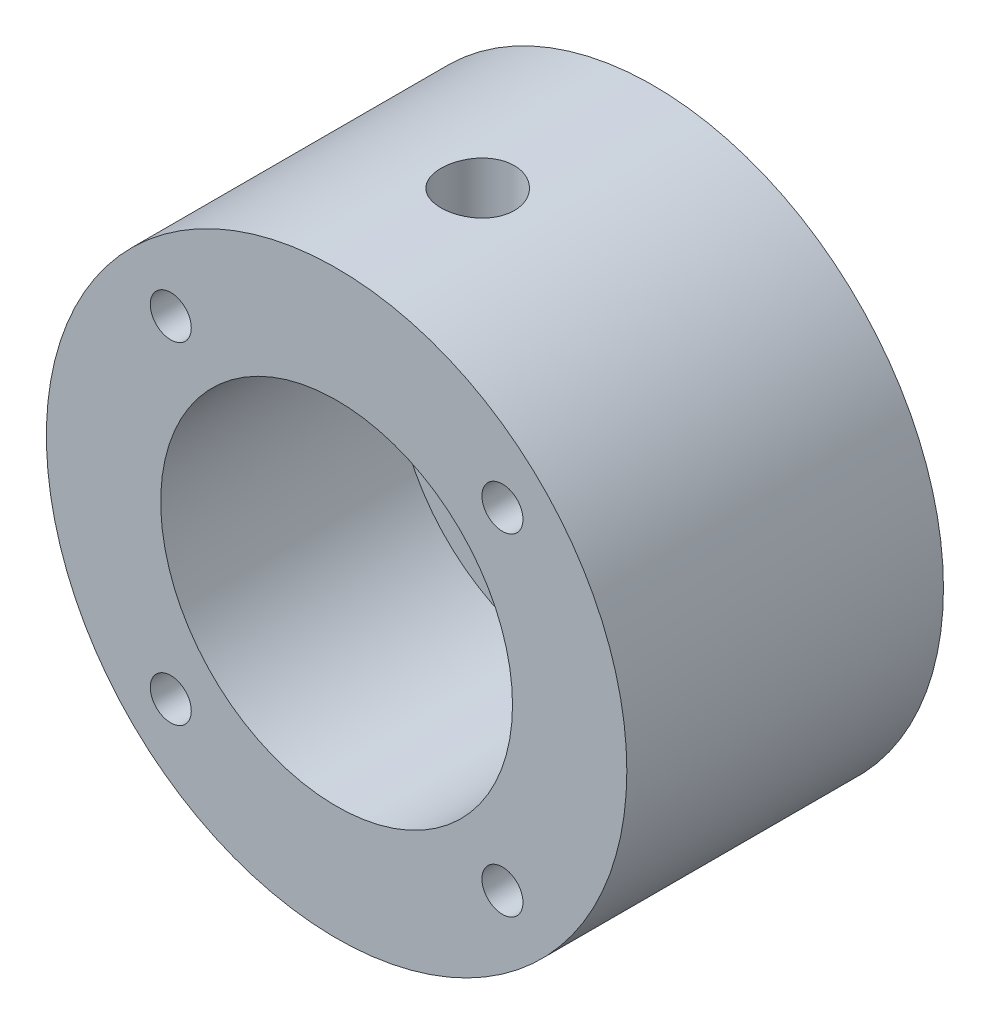
ISO-10303-21;
HEADER;
FILE_DESCRIPTION(('STEP AP214'),'2;1');
FILE_NAME('part.step','',(''),(''),'','','');
FILE_SCHEMA(('AUTOMOTIVE_DESIGN { 1 0 10303 214 1 1 1 1 }'));
ENDSEC;
DATA;
#1=APPLICATION_CONTEXT('core data for automotive mechanical design processes');
#2=APPLICATION_PROTOCOL_DEFINITION('international standard','automotive_design',2000,#1);
#3=PRODUCT_CONTEXT('',#1,'mechanical');
#4=PRODUCT('Part','Part','',(#3));
#5=PRODUCT_RELATED_PRODUCT_CATEGORY('part','',(#4));
#6=PRODUCT_DEFINITION_FORMATION('','',#4);
#7=PRODUCT_DEFINITION_CONTEXT('part definition',#1,'design');
#8=PRODUCT_DEFINITION('design','',#6,#7);
#9=PRODUCT_DEFINITION_SHAPE('','',#8);
#10=(LENGTH_UNIT() NAMED_UNIT(*) SI_UNIT(.MILLI.,.METRE.));
#11=(NAMED_UNIT(*) PLANE_ANGLE_UNIT() SI_UNIT($,.RADIAN.));
#12=(NAMED_UNIT(*) SI_UNIT($,.STERADIAN.) SOLID_ANGLE_UNIT());
#13=UNCERTAINTY_MEASURE_WITH_UNIT(LENGTH_MEASURE(1.E-05),#10,'distance_accuracy_value','');
#14=(GEOMETRIC_REPRESENTATION_CONTEXT(3) GLOBAL_UNCERTAINTY_ASSIGNED_CONTEXT((#13)) GLOBAL_UNIT_ASSIGNED_CONTEXT((#10,
#11,#12)) REPRESENTATION_CONTEXT('',''));
#15=CARTESIAN_POINT('',(0.,0.,0.));
#16=DIRECTION('',(0.,0.,1.));
#17=DIRECTION('',(1.,0.,0.));
#18=AXIS2_PLACEMENT_3D('',#15,#16,#17);
#19=CARTESIAN_POINT('',(0.,0.,0.));
#20=DIRECTION('',(0.,0.,1.));
#21=DIRECTION('',(1.,0.,0.));
#22=AXIS2_PLACEMENT_3D('',#19,#20,#21);
#23=PLANE('',#22);
#24=CARTESIAN_POINT('',(0.,0.,0.));
#25=DIRECTION('',(0.,0.,1.));
#26=DIRECTION('',(1.,0.,0.));
#27=AXIS2_PLACEMENT_3D('',#24,#25,#26);
#28=CIRCLE('',#27,12.573);
#29=CARTESIAN_POINT('',(12.573,0.,0.));
#30=VERTEX_POINT('',#29);
#31=EDGE_CURVE('E200',#30,#30,#28,.T.);
#32=ORIENTED_EDGE('',*,*,#31,.F.);
#33=EDGE_LOOP('',(#32));
#34=FACE_BOUND('',#33,.T.);
#35=CARTESIAN_POINT('',(0.,-0.00401125007239503,0.));
#36=DIRECTION('',(0.,0.,1.));
#37=DIRECTION('',(1.,0.,0.));
#38=AXIS2_PLACEMENT_3D('',#35,#36,#37);
#39=CIRCLE('',#38,2.5);
#40=CARTESIAN_POINT('',(1.5,1.9959887499276,0.));
#41=VERTEX_POINT('',#40);
#42=CARTESIAN_POINT('',(-1.5,1.9959887499276,0.));
#43=VERTEX_POINT('',#42);
#44=EDGE_CURVE('E112',#41,#43,#39,.F.);
#45=ORIENTED_EDGE('',*,*,#44,.F.);
#46=DIRECTION('',(-1.,0.,0.));
#47=VECTOR('',#46,1.);
#48=CARTESIAN_POINT('',(0.,1.9959887499276,0.));
#49=LINE('',#48,#47);
#50=EDGE_CURVE('E114',#41,#43,#49,.T.);
#51=ORIENTED_EDGE('',*,*,#50,.T.);
#52=EDGE_LOOP('',(#45,#51));
#53=FACE_BOUND('',#52,.T.);
#54=ADVANCED_FACE('F39',(#34,#53),#23,.F.);
#55=CARTESIAN_POINT('',(0.,0.,3.556));
#56=DIRECTION('',(0.,0.,1.));
#57=DIRECTION('',(1.,0.,0.));
#58=AXIS2_PLACEMENT_3D('',#55,#56,#57);
#59=PLANE('',#58);
#60=CARTESIAN_POINT('',(0.,0.,3.556));
#61=DIRECTION('',(0.,0.,1.));
#62=DIRECTION('',(1.,0.,0.));
#63=AXIS2_PLACEMENT_3D('',#60,#61,#62);
#64=CIRCLE('',#63,7.62);
#65=CARTESIAN_POINT('',(7.62,0.,3.556));
#66=VERTEX_POINT('',#65);
#67=EDGE_CURVE('E194',#66,#66,#64,.T.);
#68=ORIENTED_EDGE('',*,*,#67,.T.);
#69=EDGE_LOOP('',(#68));
#70=FACE_BOUND('',#69,.T.);
#71=DIRECTION('',(-1.,0.,0.));
#72=VECTOR('',#71,1.);
#73=CARTESIAN_POINT('',(0.,1.9959887499276,3.556));
#74=LINE('',#73,#72);
#75=CARTESIAN_POINT('',(1.5,1.9959887499276,3.556));
#76=VERTEX_POINT('',#75);
#77=CARTESIAN_POINT('',(-1.5,1.9959887499276,3.556));
#78=VERTEX_POINT('',#77);
#79=EDGE_CURVE('E11',#76,#78,#74,.T.);
#80=ORIENTED_EDGE('',*,*,#79,.F.);
#81=CARTESIAN_POINT('',(0.,-0.00401125007239503,3.556));
#82=DIRECTION('',(0.,0.,1.));
#83=DIRECTION('',(1.,0.,0.));
#84=AXIS2_PLACEMENT_3D('',#81,#82,#83);
#85=CIRCLE('',#84,2.5);
#86=EDGE_CURVE('E48',#76,#78,#85,.F.);
#87=ORIENTED_EDGE('',*,*,#86,.T.);
#88=EDGE_LOOP('',(#80,#87));
#89=FACE_BOUND('',#88,.T.);
#90=ADVANCED_FACE('F172',(#70,#89),#59,.T.);
#91=CARTESIAN_POINT('',(0.,0.,13.716));
#92=DIRECTION('',(0.,0.,-1.));
#93=DIRECTION('',(-1.,0.,0.));
#94=AXIS2_PLACEMENT_3D('',#91,#92,#93);
#95=CYLINDRICAL_SURFACE('',#94,12.573);
#96=CARTESIAN_POINT('',(0.,12.573,9.19318645327168));
#97=CARTESIAN_POINT('',(-0.0887915993608793,12.5729987510119,9.19318268566883));
#98=CARTESIAN_POINT('',(-0.177638500143121,12.5720494891548,9.18571193537173));
#99=CARTESIAN_POINT('',(-0.352859483711236,12.5683540066791,9.15602786887836));
#100=CARTESIAN_POINT('',(-0.439230894819009,12.5656059156496,9.13379920715725));
#101=CARTESIAN_POINT('',(-0.606938890574553,12.5586223268483,9.07526510902587));
#102=CARTESIAN_POINT('',(-0.688278840436719,12.5543878361654,9.03896920194715));
#103=CARTESIAN_POINT('',(-0.84369774773727,12.5449022679493,8.95335187616064));
#104=CARTESIAN_POINT('',(-0.917777936747555,12.5396513632954,8.90403267203472));
#105=CARTESIAN_POINT('',(-1.05700552086145,12.528686166325,8.79347287135911));
#106=CARTESIAN_POINT('',(-1.12210629967878,12.522969684083,8.7321737823354));
#107=CARTESIAN_POINT('',(-1.24112558728552,12.5117352484072,8.59951986609636));
#108=CARTESIAN_POINT('',(-1.29504352290845,12.5062173051614,8.52816452377154));
#109=CARTESIAN_POINT('',(-1.39034058954628,12.4959831631038,8.37712020401942));
#110=CARTESIAN_POINT('',(-1.43167597928432,12.4912697856222,8.29740342165806));
#111=CARTESIAN_POINT('',(-1.50035524050824,12.4832073647819,8.13209013827831));
#112=CARTESIAN_POINT('',(-1.52769965312951,12.4798582686573,8.04649386480892));
#113=CARTESIAN_POINT('',(-1.56747895428156,12.474924546565,7.87233548343039));
#114=CARTESIAN_POINT('',(-1.5799926066223,12.4733306024976,7.78379163445047));
#115=CARTESIAN_POINT('',(-1.58999890527762,12.4720591485548,7.60584740609685));
#116=CARTESIAN_POINT('',(-1.58749216750355,12.4723815600991,7.51644706199383));
#117=CARTESIAN_POINT('',(-1.56759348558035,12.4748978619163,7.33987685669055));
#118=CARTESIAN_POINT('',(-1.55028834769949,12.4770808380142,7.25269703515033));
#119=CARTESIAN_POINT('',(-1.50141955438437,12.4830552772494,7.08248874504414));
#120=CARTESIAN_POINT('',(-1.4698556047008,12.4868467735806,6.99946036218783));
#121=CARTESIAN_POINT('',(-1.39327200916297,12.4956234052506,6.83964240672756));
#122=CARTESIAN_POINT('',(-1.34821468527253,12.5006118750859,6.76287107975228));
#123=CARTESIAN_POINT('',(-1.24595030190667,12.511217806581,6.61794644129578));
#124=CARTESIAN_POINT('',(-1.18874267548034,12.5168352975862,6.54979353219938));
#125=CARTESIAN_POINT('',(-1.06332073081779,12.5281148217054,6.42353652422462));
#126=CARTESIAN_POINT('',(-0.995031598885224,12.5337768894343,6.36550672146737));
#127=CARTESIAN_POINT('',(-0.849642593472436,12.5444705199704,6.26172181526025));
#128=CARTESIAN_POINT('',(-0.772542698967229,12.549502081273,6.21596674110225));
#129=CARTESIAN_POINT('',(-0.611663126698051,12.5583709912837,6.13802988066634));
#130=CARTESIAN_POINT('',(-0.527881146856315,12.5622079261733,6.10585279643482));
#131=CARTESIAN_POINT('',(-0.356044066550023,12.5682515248352,6.05604454582067));
#132=CARTESIAN_POINT('',(-0.267989170435803,12.570458266489,6.03841268454367));
#133=CARTESIAN_POINT('',(-0.0907481590614357,12.5729827055122,6.0182917930641));
#134=CARTESIAN_POINT('',(-0.00157383608342235,12.5733131689507,6.01570042567167));
#135=CARTESIAN_POINT('',(0.175937835856798,12.5720822981244,6.02546393953009));
#136=CARTESIAN_POINT('',(0.264275202971462,12.5705210049843,6.03781849587246));
#137=CARTESIAN_POINT('',(0.43730305412847,12.5656900062323,6.07703813686241));
#138=CARTESIAN_POINT('',(0.522004783951326,12.5624260526284,6.103854376614));
#139=CARTESIAN_POINT('',(0.68570895557491,12.5545551259567,6.1711853534304));
#140=CARTESIAN_POINT('',(0.764711200172747,12.5499481064465,6.21170056420574));
#141=CARTESIAN_POINT('',(0.915230533722313,12.5398727779337,6.30552665448981));
#142=CARTESIAN_POINT('',(0.986706095634841,12.5344000690126,6.35890367261945));
#143=CARTESIAN_POINT('',(1.11972051754943,12.523219189965,6.47684470060266));
#144=CARTESIAN_POINT('',(1.18125897461438,12.5175110103022,6.54140916387312));
#145=CARTESIAN_POINT('',(1.29301585758062,12.5064630998467,6.68034334798512));
#146=CARTESIAN_POINT('',(1.34316641046082,12.5011257033795,6.75476787774722));
#147=CARTESIAN_POINT('',(1.43025486628691,12.4914622064419,6.91104382919775));
#148=CARTESIAN_POINT('',(1.46719303862098,12.487136085353,6.99289509941915));
#149=CARTESIAN_POINT('',(1.52669852781256,12.4800009003132,7.16148284620904));
#150=CARTESIAN_POINT('',(1.54930399356787,12.4771878122287,7.24820567997905));
#151=CARTESIAN_POINT('',(1.57962517190742,12.4733856940815,7.42425417465583));
#152=CARTESIAN_POINT('',(1.58734159238748,12.4723965772986,7.51357971161275));
#153=CARTESIAN_POINT('',(1.587652473349,12.4723569530988,7.69162268469245));
#154=CARTESIAN_POINT('',(1.58035356853937,12.4732927752892,7.78033995043693));
#155=CARTESIAN_POINT('',(1.55106692342149,12.4769681795771,7.95527593653533));
#156=CARTESIAN_POINT('',(1.52907918253632,12.4797077617455,8.04149465679111));
#157=CARTESIAN_POINT('',(1.47107256413099,12.4866777496136,8.20897136283367));
#158=CARTESIAN_POINT('',(1.43505893175452,12.4909075979548,8.29023118993137));
#159=CARTESIAN_POINT('',(1.35003331696083,12.5003824283217,8.44557150055178));
#160=CARTESIAN_POINT('',(1.30102115861577,12.5056274240866,8.51965188688624));
#161=CARTESIAN_POINT('',(1.19099451495339,12.5165861851667,8.6590753974682));
#162=CARTESIAN_POINT('',(1.12990057562189,12.5223028992503,8.7243555930023));
#163=CARTESIAN_POINT('',(0.997610482452175,12.5335349972055,8.84377816219664));
#164=CARTESIAN_POINT('',(0.926411951952195,12.539050333327,8.89791790819445));
#165=CARTESIAN_POINT('',(0.775616588020509,12.5492819129587,8.99370199983273));
#166=CARTESIAN_POINT('',(0.695988255285262,12.5539949744898,9.03529707175337));
#167=CARTESIAN_POINT('',(0.53086134962478,12.5620587782326,9.10446533667289));
#168=CARTESIAN_POINT('',(0.445369256284219,12.5654109967341,9.13205373278908));
#169=CARTESIAN_POINT('',(0.299531280727683,12.5695693073724,9.16583767282748));
#170=CARTESIAN_POINT('',(0.240104199973876,12.5708495337855,9.1760786829068));
#171=CARTESIAN_POINT('',(0.120459894364099,12.5725653006002,9.18975432544089));
#172=CARTESIAN_POINT('',(0.0602426755008257,12.5730008474043,9.19318900948732));
#173=CARTESIAN_POINT('',(0.,12.573,9.19318645327168));
#174=B_SPLINE_CURVE_WITH_KNOTS('',3,(#96,#97,#98,#99,#100,#101,#102,#103,#104,#105,#106,#107,
#108,#109,#110,#111,#112,#113,#114,#115,#116,#117,#118,#119,#120,#121,#122,#123,#124,#125,#126,
#127,#128,#129,#130,#131,#132,#133,#134,#135,#136,#137,#138,#139,#140,#141,#142,#143,#144,#145,
#146,#147,#148,#149,#150,#151,#152,#153,#154,#155,#156,#157,#158,#159,#160,#161,#162,#163,#164,
#165,#166,#167,#168,#169,#170,#171,#172,#173),.UNSPECIFIED.,.T.,.F.,(4,2,2,2,2,2,2,2,2,2,2,2,2,
2,2,2,2,2,2,2,2,2,2,2,2,2,2,2,2,2,2,2,2,2,2,2,2,2,4),(0.,0.266154746647172,0.53258667983895,
0.798838443210823,1.06504496020299,1.33258527003566,1.60013928901753,1.86861306680041,
2.13707645991589,2.40410760483715,2.67112780021679,2.9365923364475,3.2020623511377,
3.46828067101348,3.73451141575598,4.00262065025124,4.27073052454464,4.53893316901579,
4.8071229994309,5.07348587749637,5.3398429652204,5.60530600493466,5.87077822530202,
6.1376458500812,6.40452429329135,6.67295388437765,6.94137800212162,7.20908463125666,
7.47677853203559,7.74257790839685,8.00837729519733,8.27407737855054,8.53978105819013,
8.80729397267205,9.07486991243139,9.34348356049403,9.61180502340948,9.7923851198168,
9.97296384742934),.UNSPECIFIED.);
#175=CARTESIAN_POINT('',(0.,12.573,9.19318645327168));
#176=VERTEX_POINT('',#175);
#177=EDGE_CURVE('E124',#176,#176,#174,.T.);
#178=ORIENTED_EDGE('',*,*,#177,.T.);
#179=EDGE_LOOP('',(#178));
#180=FACE_BOUND('',#179,.T.);
#181=CARTESIAN_POINT('',(0.,0.,13.716));
#182=DIRECTION('',(0.,0.,1.));
#183=DIRECTION('',(1.,0.,0.));
#184=AXIS2_PLACEMENT_3D('',#181,#182,#183);
#185=CIRCLE('',#184,12.573);
#186=CARTESIAN_POINT('',(12.573,0.,13.716));
#187=VERTEX_POINT('',#186);
#188=EDGE_CURVE('E203',#187,#187,#185,.T.);
#189=ORIENTED_EDGE('',*,*,#188,.F.);
#190=EDGE_LOOP('',(#189));
#191=FACE_BOUND('',#190,.T.);
#192=ORIENTED_EDGE('',*,*,#31,.T.);
#193=EDGE_LOOP('',(#192));
#194=FACE_BOUND('',#193,.T.);
#195=ADVANCED_FACE('F41',(#180,#191,#194),#95,.T.);
#196=CARTESIAN_POINT('',(0.,0.,13.716));
#197=DIRECTION('',(0.,0.,1.));
#198=DIRECTION('',(1.,0.,0.));
#199=AXIS2_PLACEMENT_3D('',#196,#197,#198);
#200=PLANE('',#199);
#201=CARTESIAN_POINT('',(-7.18420489685516,-7.18821614692788,13.716));
#202=DIRECTION('',(0.,0.,1.));
#203=DIRECTION('',(1.,0.,0.));
#204=AXIS2_PLACEMENT_3D('',#201,#202,#203);
#205=CIRCLE('',#204,0.888999999999989);
#206=CARTESIAN_POINT('',(-6.29520489685517,-7.18821614692788,13.716));
#207=VERTEX_POINT('',#206);
#208=EDGE_CURVE('E88',#207,#207,#205,.T.);
#209=ORIENTED_EDGE('',*,*,#208,.F.);
#210=EDGE_LOOP('',(#209));
#211=FACE_BOUND('',#210,.T.);
#212=CARTESIAN_POINT('',(-7.18420489685541,7.18019364678284,13.716));
#213=DIRECTION('',(0.,0.,1.));
#214=DIRECTION('',(1.,0.,0.));
#215=AXIS2_PLACEMENT_3D('',#212,#213,#214);
#216=CIRCLE('',#215,0.888999999999989);
#217=CARTESIAN_POINT('',(-6.29520489685542,7.18019364678284,13.716));
#218=VERTEX_POINT('',#217);
#219=EDGE_CURVE('E87',#218,#218,#216,.T.);
#220=ORIENTED_EDGE('',*,*,#219,.F.);
#221=EDGE_LOOP('',(#220));
#222=FACE_BOUND('',#221,.T.);
#223=CARTESIAN_POINT('',(7.18420489685521,7.18019364678304,13.716));
#224=DIRECTION('',(0.,0.,1.));
#225=DIRECTION('',(1.,0.,0.));
#226=AXIS2_PLACEMENT_3D('',#223,#224,#225);
#227=CIRCLE('',#226,0.888999999999988);
#228=CARTESIAN_POINT('',(8.0732048968552,7.18019364678304,13.716));
#229=VERTEX_POINT('',#228);
#230=EDGE_CURVE('E98',#229,#229,#227,.T.);
#231=ORIENTED_EDGE('',*,*,#230,.F.);
#232=EDGE_LOOP('',(#231));
#233=FACE_BOUND('',#232,.T.);
#234=CARTESIAN_POINT('',(7.18420489685541,-7.18821614692763,13.716));
#235=DIRECTION('',(0.,0.,1.));
#236=DIRECTION('',(1.,0.,0.));
#237=AXIS2_PLACEMENT_3D('',#234,#235,#236);
#238=CIRCLE('',#237,0.888999999999989);
#239=CARTESIAN_POINT('',(8.0732048968554,-7.18821614692763,13.716));
#240=VERTEX_POINT('',#239);
#241=EDGE_CURVE('E104',#240,#240,#238,.T.);
#242=ORIENTED_EDGE('',*,*,#241,.F.);
#243=EDGE_LOOP('',(#242));
#244=FACE_BOUND('',#243,.T.);
#245=CARTESIAN_POINT('',(0.,0.,13.716));
#246=DIRECTION('',(0.,0.,1.));
#247=DIRECTION('',(1.,0.,0.));
#248=AXIS2_PLACEMENT_3D('',#245,#246,#247);
#249=CIRCLE('',#248,7.62);
#250=CARTESIAN_POINT('',(7.62,0.,13.716));
#251=VERTEX_POINT('',#250);
#252=EDGE_CURVE('E197',#251,#251,#249,.T.);
#253=ORIENTED_EDGE('',*,*,#252,.F.);
#254=EDGE_LOOP('',(#253));
#255=FACE_BOUND('',#254,.T.);
#256=ORIENTED_EDGE('',*,*,#188,.T.);
#257=EDGE_LOOP('',(#256));
#258=FACE_BOUND('',#257,.T.);
#259=ADVANCED_FACE('F181',(#211,#222,#233,#244,#255,#258),#200,.T.);
#260=CARTESIAN_POINT('',(0.,0.,3.556));
#261=DIRECTION('',(0.,0.,1.));
#262=DIRECTION('',(1.,0.,0.));
#263=AXIS2_PLACEMENT_3D('',#260,#261,#262);
#264=CYLINDRICAL_SURFACE('',#263,7.62);
#265=CARTESIAN_POINT('',(0.,7.62,9.19318645327168));
#266=CARTESIAN_POINT('',(0.088149482961108,7.61999836838847,9.19318330688576));
#267=CARTESIAN_POINT('',(0.176337962691511,7.61845477544304,9.18581960780886));
#268=CARTESIAN_POINT('',(0.350216871659079,7.61244605258163,9.15658587936495));
#269=CARTESIAN_POINT('',(0.435905351362955,7.60797870310345,9.13470482901477));
#270=CARTESIAN_POINT('',(0.602245598010001,7.59662068679176,9.07714597552097));
#271=CARTESIAN_POINT('',(0.682902287620661,7.58973243356859,9.04148191035309));
#272=CARTESIAN_POINT('',(0.837082817329563,7.5742790831852,8.95741145002433));
#273=CARTESIAN_POINT('',(0.910606976768591,7.56571406114988,8.90900562570377));
#274=CARTESIAN_POINT('',(1.04951571187222,7.54770779031306,8.80007530122956));
#275=CARTESIAN_POINT('',(1.1147809100866,7.53825652427635,8.73940021170312));
#276=CARTESIAN_POINT('',(1.23428477649712,7.51961485269409,8.60797723609389));
#277=CARTESIAN_POINT('',(1.28852253212045,7.51042446879187,8.5372285171939));
#278=CARTESIAN_POINT('',(1.38494810230065,7.49324692096041,8.38679745293866));
#279=CARTESIAN_POINT('',(1.42701079444426,7.48527262372032,8.3070333049532));
#280=CARTESIAN_POINT('',(1.4970902157204,7.47157307625526,8.14137568952028));
#281=CARTESIAN_POINT('',(1.52510845812904,7.46584758373812,8.05548288356966));
#282=CARTESIAN_POINT('',(1.56591304969845,7.45739556252376,7.88129520175382));
#283=CARTESIAN_POINT('',(1.57890969074934,7.45462767206949,7.79305163691653));
#284=CARTESIAN_POINT('',(1.5899556422263,7.45227987209943,7.61559646283614));
#285=CARTESIAN_POINT('',(1.58800661436252,7.45269960817246,7.52638496231276));
#286=CARTESIAN_POINT('',(1.5693862317724,7.45664211385352,7.35107554774321));
#287=CARTESIAN_POINT('',(1.55295733645554,7.46011377773474,7.26495055910194));
#288=CARTESIAN_POINT('',(1.5062269028303,7.46968835772246,7.09670663602263));
#289=CARTESIAN_POINT('',(1.47592465141354,7.47579140908473,7.01458790775164));
#290=CARTESIAN_POINT('',(1.40208004081688,7.48999253159409,6.85599627318339));
#291=CARTESIAN_POINT('',(1.3584428321848,7.49810481307694,6.7795688566823));
#292=CARTESIAN_POINT('',(1.25923382807901,7.51540140313616,6.63503085805112));
#293=CARTESIAN_POINT('',(1.20366054957348,7.52458584486142,6.56692131105));
#294=CARTESIAN_POINT('',(1.08086515036441,7.54321238280984,6.43955472269961));
#295=CARTESIAN_POINT('',(1.01343642043334,7.55265600463331,6.38049691877248));
#296=CARTESIAN_POINT('',(0.869527456536978,7.57057271941611,6.27449729164089));
#297=CARTESIAN_POINT('',(0.793047086782717,7.579045797812,6.22755565023172));
#298=CARTESIAN_POINT('',(0.632975037369053,7.59409036097375,6.14707864972103));
#299=CARTESIAN_POINT('',(0.549370836646651,7.60065840432027,6.11356751147145));
#300=CARTESIAN_POINT('',(0.377551468634634,7.61112699528327,6.06112298813061));
#301=CARTESIAN_POINT('',(0.289336910015761,7.61502789406988,6.04218768386781));
#302=CARTESIAN_POINT('',(0.112511669440059,7.61967329523628,6.01971775314547));
#303=CARTESIAN_POINT('',(0.0239370305182454,7.62047362792725,6.01591068757399));
#304=CARTESIAN_POINT('',(-0.152582624422298,7.61898339361022,6.02306953973245));
#305=CARTESIAN_POINT('',(-0.240527678662068,7.61669301586155,6.03403455289572));
#306=CARTESIAN_POINT('',(-0.412402486242162,7.60931377523564,6.07020013317799));
#307=CARTESIAN_POINT('',(-0.496363234975641,7.60425267142458,6.09525955970869));
#308=CARTESIAN_POINT('',(-0.658890537259889,7.59189778597841,6.15874733600688));
#309=CARTESIAN_POINT('',(-0.737456661147703,7.58460382675615,6.19717674917148));
#310=CARTESIAN_POINT('',(-0.888103769818236,7.56845376693207,6.28689353363339));
#311=CARTESIAN_POINT('',(-0.960085988726687,7.55957840141659,6.3383432038244));
#312=CARTESIAN_POINT('',(-1.09449291627588,7.5412926174063,6.45242429837855));
#313=CARTESIAN_POINT('',(-1.15691650494987,7.53188213638989,6.51505703118074));
#314=CARTESIAN_POINT('',(-1.27149688378778,7.51339651154848,6.65097103606131));
#315=CARTESIAN_POINT('',(-1.32346591542259,7.50432953420526,6.72441190385489));
#316=CARTESIAN_POINT('',(-1.41433193230639,7.48773713290073,6.87914013422319));
#317=CARTESIAN_POINT('',(-1.45322946180887,7.48021164476207,6.96042716992835));
#318=CARTESIAN_POINT('',(-1.51659902983781,7.46762159899212,7.12811717257044));
#319=CARTESIAN_POINT('',(-1.541148934816,7.46254378436552,7.2144896704723));
#320=CARTESIAN_POINT('',(-1.57535928924727,7.45539764581315,7.39025197239685));
#321=CARTESIAN_POINT('',(-1.58502186861439,7.45332889138666,7.47964134292837));
#322=CARTESIAN_POINT('',(-1.58909926639266,7.45246042281803,7.65701147254124));
#323=CARTESIAN_POINT('',(-1.58381119130861,7.45359700948307,7.74498522245369));
#324=CARTESIAN_POINT('',(-1.5587967974882,7.45886808013758,7.91875924460036));
#325=CARTESIAN_POINT('',(-1.53907061733477,7.46300253535225,8.00455953768813));
#326=CARTESIAN_POINT('',(-1.48587736566102,7.47377388208599,8.17134162357282));
#327=CARTESIAN_POINT('',(-1.45244969311894,7.48040359400071,8.25233647631008));
#328=CARTESIAN_POINT('',(-1.37283770770691,7.49542196288197,8.40761369882555));
#329=CARTESIAN_POINT('',(-1.32665221058447,7.50381078312134,8.48189544460575));
#330=CARTESIAN_POINT('',(-1.22183359308486,7.52159506029955,8.62311091966258));
#331=CARTESIAN_POINT('',(-1.16298712083114,7.53100619612873,8.68988434146921));
#332=CARTESIAN_POINT('',(-1.03495403640647,7.5496653627068,8.81270650966915));
#333=CARTESIAN_POINT('',(-0.965765046917863,7.55891335540797,8.86875278356207));
#334=CARTESIAN_POINT('',(-0.818050722934778,7.57633034575499,8.96914394121543));
#335=CARTESIAN_POINT('',(-0.739426920332108,7.5844856701302,9.01334642672726));
#336=CARTESIAN_POINT('',(-0.575716201878033,7.59866283787497,9.08784024337781));
#337=CARTESIAN_POINT('',(-0.490635013022197,7.60468654551268,9.11814373719266));
#338=CARTESIAN_POINT('',(-0.337839421983132,7.61279274722433,9.15831260669797));
#339=CARTESIAN_POINT('',(-0.270976844034469,7.61547925289971,9.17136628254692));
#340=CARTESIAN_POINT('',(-0.136083896204202,7.61908347642993,9.18880426020389));
#341=CARTESIAN_POINT('',(-0.0680535695680676,7.62000125964424,9.19318888235901));
#342=CARTESIAN_POINT('',(0.,7.62,9.19318645327168));
#343=B_SPLINE_CURVE_WITH_KNOTS('',3,(#265,#266,#267,#268,#269,#270,#271,#272,#273,#274,#275,
#276,#277,#278,#279,#280,#281,#282,#283,#284,#285,#286,#287,#288,#289,#290,#291,#292,#293,#294,
#295,#296,#297,#298,#299,#300,#301,#302,#303,#304,#305,#306,#307,#308,#309,#310,#311,#312,#313,
#314,#315,#316,#317,#318,#319,#320,#321,#322,#323,#324,#325,#326,#327,#328,#329,#330,#331,#332,
#333,#334,#335,#336,#337,#338,#339,#340,#341,#342),.UNSPECIFIED.,.T.,.F.,(4,2,2,2,2,2,2,2,2,2,2,
2,2,2,2,2,2,2,2,2,2,2,2,2,2,2,2,2,2,2,2,2,2,2,2,2,2,2,4),(0.,0.264199427281042,
0.528599653880904,0.792737021108309,1.05686255679769,1.32445158512915,1.59206274870767,
1.86233370456756,2.13257553272572,2.39898650465714,2.66536785654298,2.92737174403905,
3.18938910038454,3.4533153236927,3.71727435827402,3.9863969847144,4.25552364893335,
4.5251335011457,4.79470784828128,5.05940491047746,5.3240857647139,5.58616214023427,
5.84825936506483,6.11380011674583,6.37937195757006,6.64935505063255,6.9193269011116,
7.18781963620679,7.45627395476012,7.71943113579616,7.98258579097326,8.24498898869431,
8.50741655233477,8.77467161534489,9.04198820399056,9.31238757785782,9.58254987810513,
9.78652587366142,9.99049433156203),.UNSPECIFIED.);
#344=CARTESIAN_POINT('',(0.,7.62,9.19318645327168));
#345=VERTEX_POINT('',#344);
#346=EDGE_CURVE('E117',#345,#345,#343,.T.);
#347=ORIENTED_EDGE('',*,*,#346,.T.);
#348=EDGE_LOOP('',(#347));
#349=FACE_BOUND('',#348,.T.);
#350=ORIENTED_EDGE('',*,*,#67,.F.);
#351=EDGE_LOOP('',(#350));
#352=FACE_BOUND('',#351,.T.);
#353=ORIENTED_EDGE('',*,*,#252,.T.);
#354=EDGE_LOOP('',(#353));
#355=FACE_BOUND('',#354,.T.);
#356=ADVANCED_FACE('F135',(#349,#352,#355),#264,.F.);
#357=CARTESIAN_POINT('',(0.,12.573,7.60568645327168));
#358=DIRECTION('',(0.,1.,0.));
#359=DIRECTION('',(0.,0.,1.));
#360=AXIS2_PLACEMENT_3D('',#357,#358,#359);
#361=CYLINDRICAL_SURFACE('',#360,1.58749999999999);
#362=ORIENTED_EDGE('',*,*,#346,.F.);
#363=EDGE_LOOP('',(#362));
#364=FACE_BOUND('',#363,.T.);
#365=ORIENTED_EDGE('',*,*,#177,.F.);
#366=EDGE_LOOP('',(#365));
#367=FACE_BOUND('',#366,.T.);
#368=ADVANCED_FACE('F130',(#364,#367),#361,.F.);
#369=CARTESIAN_POINT('',(0.,1.9959887499276,-2.38));
#370=DIRECTION('',(0.,1.,0.));
#371=DIRECTION('',(0.,0.,1.));
#372=AXIS2_PLACEMENT_3D('',#369,#370,#371);
#373=PLANE('',#372);
#374=DIRECTION('',(0.,0.,1.));
#375=VECTOR('',#374,1.);
#376=CARTESIAN_POINT('',(1.5,1.9959887499276,-2.38));
#377=LINE('',#376,#375);
#378=EDGE_CURVE('E55',#41,#76,#377,.T.);
#379=ORIENTED_EDGE('',*,*,#378,.T.);
#380=ORIENTED_EDGE('',*,*,#79,.T.);
#381=DIRECTION('',(0.,0.,1.));
#382=VECTOR('',#381,1.);
#383=CARTESIAN_POINT('',(-1.5,1.9959887499276,-2.38));
#384=LINE('',#383,#382);
#385=EDGE_CURVE('E60',#43,#78,#384,.T.);
#386=ORIENTED_EDGE('',*,*,#385,.F.);
#387=ORIENTED_EDGE('',*,*,#50,.F.);
#388=EDGE_LOOP('',(#379,#380,#386,#387));
#389=FACE_BOUND('',#388,.T.);
#390=ADVANCED_FACE('F134',(#389),#373,.F.);
#391=CARTESIAN_POINT('',(0.,-0.00401125007239503,-2.38));
#392=DIRECTION('',(0.,0.,1.));
#393=DIRECTION('',(1.,0.,0.));
#394=AXIS2_PLACEMENT_3D('',#391,#392,#393);
#395=CYLINDRICAL_SURFACE('',#394,2.5);
#396=ORIENTED_EDGE('',*,*,#44,.T.);
#397=ORIENTED_EDGE('',*,*,#385,.T.);
#398=ORIENTED_EDGE('',*,*,#86,.F.);
#399=ORIENTED_EDGE('',*,*,#378,.F.);
#400=EDGE_LOOP('',(#396,#397,#398,#399));
#401=FACE_BOUND('',#400,.T.);
#402=ADVANCED_FACE('F140',(#401),#395,.F.);
#403=CARTESIAN_POINT('',(7.18420489685541,-7.18821614692763,6.00202000000001));
#404=DIRECTION('',(0.,0.,1.));
#405=DIRECTION('',(1.,0.,0.));
#406=AXIS2_PLACEMENT_3D('',#403,#404,#405);
#407=CONICAL_SURFACE('',#406,0.888999999999987,1.02974425867665);
#408=CARTESIAN_POINT('',(7.18420489685541,-7.18821614692763,5.46785490968451));
#409=VERTEX_POINT('',#408);
#410=VERTEX_LOOP('',#409);
#411=FACE_BOUND('',#410,.T.);
#412=CARTESIAN_POINT('',(7.18420489685541,-7.18821614692763,6.00202000000001));
#413=DIRECTION('',(0.,0.,1.));
#414=DIRECTION('',(1.,0.,0.));
#415=AXIS2_PLACEMENT_3D('',#412,#413,#414);
#416=CIRCLE('',#415,0.888999999999987);
#417=CARTESIAN_POINT('',(8.0732048968554,-7.18821614692763,6.00202000000001));
#418=VERTEX_POINT('',#417);
#419=EDGE_CURVE('E107',#418,#418,#416,.T.);
#420=ORIENTED_EDGE('',*,*,#419,.T.);
#421=EDGE_LOOP('',(#420));
#422=FACE_BOUND('',#421,.T.);
#423=ADVANCED_FACE('F144',(#411,#422),#407,.F.);
#424=CARTESIAN_POINT('',(7.18420489685541,-7.18821614692763,13.716));
#425=DIRECTION('',(0.,0.,1.));
#426=DIRECTION('',(1.,0.,0.));
#427=AXIS2_PLACEMENT_3D('',#424,#425,#426);
#428=CYLINDRICAL_SURFACE('',#427,0.888999999999988);
#429=ORIENTED_EDGE('',*,*,#419,.F.);
#430=EDGE_LOOP('',(#429));
#431=FACE_BOUND('',#430,.T.);
#432=ORIENTED_EDGE('',*,*,#241,.T.);
#433=EDGE_LOOP('',(#432));
#434=FACE_BOUND('',#433,.T.);
#435=ADVANCED_FACE('F147',(#431,#434),#428,.F.);
#436=CARTESIAN_POINT('',(7.18420489685521,7.18019364678304,6.00202000000001));
#437=DIRECTION('',(0.,0.,1.));
#438=DIRECTION('',(1.,0.,0.));
#439=AXIS2_PLACEMENT_3D('',#436,#437,#438);
#440=CONICAL_SURFACE('',#439,0.888999999999988,1.02974425867665);
#441=CARTESIAN_POINT('',(7.18420489685521,7.18019364678304,5.46785490968451));
#442=VERTEX_POINT('',#441);
#443=VERTEX_LOOP('',#442);
#444=FACE_BOUND('',#443,.T.);
#445=CARTESIAN_POINT('',(7.18420489685521,7.18019364678304,6.00202000000001));
#446=DIRECTION('',(0.,0.,1.));
#447=DIRECTION('',(1.,0.,0.));
#448=AXIS2_PLACEMENT_3D('',#445,#446,#447);
#449=CIRCLE('',#448,0.888999999999988);
#450=CARTESIAN_POINT('',(8.0732048968552,7.18019364678304,6.00202000000001));
#451=VERTEX_POINT('',#450);
#452=EDGE_CURVE('E101',#451,#451,#449,.T.);
#453=ORIENTED_EDGE('',*,*,#452,.T.);
#454=EDGE_LOOP('',(#453));
#455=FACE_BOUND('',#454,.T.);
#456=ADVANCED_FACE('F151',(#444,#455),#440,.F.);
#457=CARTESIAN_POINT('',(7.18420489685521,7.18019364678304,13.716));
#458=DIRECTION('',(0.,0.,1.));
#459=DIRECTION('',(1.,0.,0.));
#460=AXIS2_PLACEMENT_3D('',#457,#458,#459);
#461=CYLINDRICAL_SURFACE('',#460,0.888999999999988);
#462=ORIENTED_EDGE('',*,*,#452,.F.);
#463=EDGE_LOOP('',(#462));
#464=FACE_BOUND('',#463,.T.);
#465=ORIENTED_EDGE('',*,*,#230,.T.);
#466=EDGE_LOOP('',(#465));
#467=FACE_BOUND('',#466,.T.);
#468=ADVANCED_FACE('F155',(#464,#467),#461,.F.);
#469=CARTESIAN_POINT('',(-7.18420489685541,7.18019364678284,6.00202000000001));
#470=DIRECTION('',(0.,0.,1.));
#471=DIRECTION('',(1.,0.,0.));
#472=AXIS2_PLACEMENT_3D('',#469,#470,#471);
#473=CONICAL_SURFACE('',#472,0.888999999999987,1.02974425867665);
#474=CARTESIAN_POINT('',(-7.18420489685541,7.18019364678284,5.46785490968451));
#475=VERTEX_POINT('',#474);
#476=VERTEX_LOOP('',#475);
#477=FACE_BOUND('',#476,.T.);
#478=CARTESIAN_POINT('',(-7.18420489685541,7.18019364678284,6.00202000000001));
#479=DIRECTION('',(0.,0.,1.));
#480=DIRECTION('',(1.,0.,0.));
#481=AXIS2_PLACEMENT_3D('',#478,#479,#480);
#482=CIRCLE('',#481,0.888999999999987);
#483=CARTESIAN_POINT('',(-6.29520489685542,7.18019364678284,6.00202000000001));
#484=VERTEX_POINT('',#483);
#485=EDGE_CURVE('E91',#484,#484,#482,.T.);
#486=ORIENTED_EDGE('',*,*,#485,.T.);
#487=EDGE_LOOP('',(#486));
#488=FACE_BOUND('',#487,.T.);
#489=ADVANCED_FACE('F159',(#477,#488),#473,.F.);
#490=CARTESIAN_POINT('',(-7.18420489685541,7.18019364678284,13.716));
#491=DIRECTION('',(0.,0.,1.));
#492=DIRECTION('',(1.,0.,0.));
#493=AXIS2_PLACEMENT_3D('',#490,#491,#492);
#494=CYLINDRICAL_SURFACE('',#493,0.888999999999988);
#495=ORIENTED_EDGE('',*,*,#485,.F.);
#496=EDGE_LOOP('',(#495));
#497=FACE_BOUND('',#496,.T.);
#498=ORIENTED_EDGE('',*,*,#219,.T.);
#499=EDGE_LOOP('',(#498));
#500=FACE_BOUND('',#499,.T.);
#501=ADVANCED_FACE('F81',(#497,#500),#494,.F.);
#502=CARTESIAN_POINT('',(-7.18420489685516,-7.18821614692788,6.00202000000001));
#503=DIRECTION('',(0.,0.,1.));
#504=DIRECTION('',(1.,0.,0.));
#505=AXIS2_PLACEMENT_3D('',#502,#503,#504);
#506=CONICAL_SURFACE('',#505,0.888999999999987,1.02974425867665);
#507=CARTESIAN_POINT('',(-7.18420489685516,-7.18821614692788,5.46785490968451));
#508=VERTEX_POINT('',#507);
#509=VERTEX_LOOP('',#508);
#510=FACE_BOUND('',#509,.T.);
#511=CARTESIAN_POINT('',(-7.18420489685516,-7.18821614692788,6.00202000000001));
#512=DIRECTION('',(0.,0.,1.));
#513=DIRECTION('',(1.,0.,0.));
#514=AXIS2_PLACEMENT_3D('',#511,#512,#513);
#515=CIRCLE('',#514,0.888999999999987);
#516=CARTESIAN_POINT('',(-6.29520489685517,-7.18821614692788,6.00202000000001));
#517=VERTEX_POINT('',#516);
#518=EDGE_CURVE('E85',#517,#517,#515,.T.);
#519=ORIENTED_EDGE('',*,*,#518,.T.);
#520=EDGE_LOOP('',(#519));
#521=FACE_BOUND('',#520,.T.);
#522=ADVANCED_FACE('F77',(#510,#521),#506,.F.);
#523=CARTESIAN_POINT('',(-7.18420489685516,-7.18821614692788,13.716));
#524=DIRECTION('',(0.,0.,1.));
#525=DIRECTION('',(1.,0.,0.));
#526=AXIS2_PLACEMENT_3D('',#523,#524,#525);
#527=CYLINDRICAL_SURFACE('',#526,0.888999999999988);
#528=ORIENTED_EDGE('',*,*,#518,.F.);
#529=EDGE_LOOP('',(#528));
#530=FACE_BOUND('',#529,.T.);
#531=ORIENTED_EDGE('',*,*,#208,.T.);
#532=EDGE_LOOP('',(#531));
#533=FACE_BOUND('',#532,.T.);
#534=ADVANCED_FACE('F80',(#530,#533),#527,.F.);
#535=CLOSED_SHELL('',(#54,#90,#195,#259,#356,#368,#390,#402,#423,#435,#456,#468,#489,#501,#522,#534));
#536=MANIFOLD_SOLID_BREP('B2',#535);
#537=ADVANCED_BREP_SHAPE_REPRESENTATION('',(#18,#536),#14);
#538=SHAPE_DEFINITION_REPRESENTATION(#9,#537);
ENDSEC;
END-ISO-10303-21;
